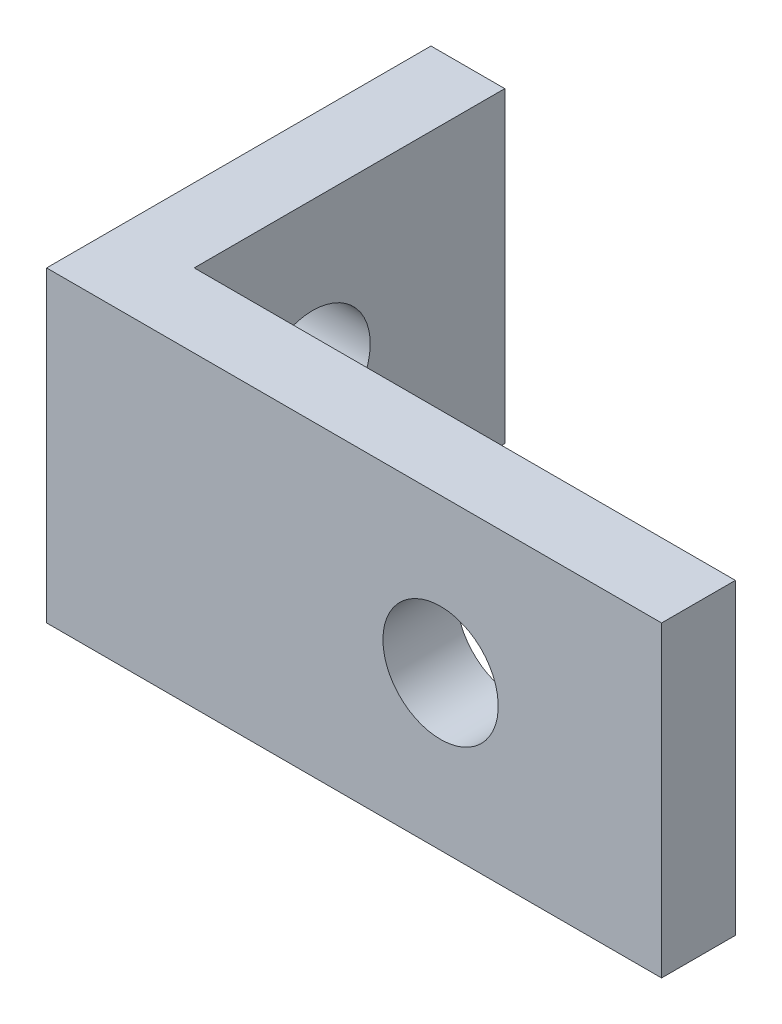
ISO-10303-21;
HEADER;
FILE_DESCRIPTION(('STEP AP214'),'2;1');
FILE_NAME('part.step','',(''),(''),'','','');
FILE_SCHEMA(('AUTOMOTIVE_DESIGN { 1 0 10303 214 1 1 1 1 }'));
ENDSEC;
DATA;
#1=APPLICATION_CONTEXT('core data for automotive mechanical design processes');
#2=APPLICATION_PROTOCOL_DEFINITION('international standard','automotive_design',2000,#1);
#3=PRODUCT_CONTEXT('',#1,'mechanical');
#4=PRODUCT('Part','Part','',(#3));
#5=PRODUCT_RELATED_PRODUCT_CATEGORY('part','',(#4));
#6=PRODUCT_DEFINITION_FORMATION('','',#4);
#7=PRODUCT_DEFINITION_CONTEXT('part definition',#1,'design');
#8=PRODUCT_DEFINITION('design','',#6,#7);
#9=PRODUCT_DEFINITION_SHAPE('','',#8);
#10=(LENGTH_UNIT() NAMED_UNIT(*) SI_UNIT(.MILLI.,.METRE.));
#11=(NAMED_UNIT(*) PLANE_ANGLE_UNIT() SI_UNIT($,.RADIAN.));
#12=(NAMED_UNIT(*) SI_UNIT($,.STERADIAN.) SOLID_ANGLE_UNIT());
#13=UNCERTAINTY_MEASURE_WITH_UNIT(LENGTH_MEASURE(1.E-05),#10,'distance_accuracy_value','');
#14=(GEOMETRIC_REPRESENTATION_CONTEXT(3) GLOBAL_UNCERTAINTY_ASSIGNED_CONTEXT((#13)) GLOBAL_UNIT_ASSIGNED_CONTEXT((#10,
#11,#12)) REPRESENTATION_CONTEXT('',''));
#15=CARTESIAN_POINT('',(0.,0.,0.));
#16=DIRECTION('',(0.,0.,1.));
#17=DIRECTION('',(1.,0.,0.));
#18=AXIS2_PLACEMENT_3D('',#15,#16,#17);
#19=CARTESIAN_POINT('',(0.,0.,3.048));
#20=DIRECTION('',(1.,0.,0.));
#21=DIRECTION('',(0.,0.,-1.));
#22=AXIS2_PLACEMENT_3D('',#19,#20,#21);
#23=PLANE('',#22);
#24=CARTESIAN_POINT('',(0.,6.35,-4.8895));
#25=DIRECTION('',(1.,0.,0.));
#26=DIRECTION('',(0.,1.,0.));
#27=AXIS2_PLACEMENT_3D('',#24,#25,#26);
#28=CIRCLE('',#27,2.38125);
#29=CARTESIAN_POINT('',(0.,8.73125,-4.8895));
#30=VERTEX_POINT('',#29);
#31=EDGE_CURVE('E166',#30,#30,#28,.T.);
#32=ORIENTED_EDGE('',*,*,#31,.T.);
#33=EDGE_LOOP('',(#32));
#34=FACE_BOUND('',#33,.T.);
#35=DIRECTION('',(0.,0.,-1.));
#36=VECTOR('',#35,1.);
#37=CARTESIAN_POINT('',(0.,12.7,3.048));
#38=LINE('',#37,#36);
#39=CARTESIAN_POINT('',(0.,12.7,3.048));
#40=VERTEX_POINT('',#39);
#41=CARTESIAN_POINT('',(0.,12.7,-12.827));
#42=VERTEX_POINT('',#41);
#43=EDGE_CURVE('E108',#40,#42,#38,.T.);
#44=ORIENTED_EDGE('',*,*,#43,.T.);
#45=DIRECTION('',(0.,-1.,0.));
#46=VECTOR('',#45,1.);
#47=CARTESIAN_POINT('',(0.,12.7,-12.827));
#48=LINE('',#47,#46);
#49=CARTESIAN_POINT('',(0.,0.,-12.827));
#50=VERTEX_POINT('',#49);
#51=EDGE_CURVE('E103',#42,#50,#48,.T.);
#52=ORIENTED_EDGE('',*,*,#51,.T.);
#53=DIRECTION('',(0.,0.,-1.));
#54=VECTOR('',#53,1.);
#55=CARTESIAN_POINT('',(0.,0.,3.048));
#56=LINE('',#55,#54);
#57=CARTESIAN_POINT('',(0.,0.,3.048));
#58=VERTEX_POINT('',#57);
#59=EDGE_CURVE('E40',#58,#50,#56,.T.);
#60=ORIENTED_EDGE('',*,*,#59,.F.);
#61=DIRECTION('',(0.,-1.,0.));
#62=VECTOR('',#61,1.);
#63=CARTESIAN_POINT('',(0.,0.,3.048));
#64=LINE('',#63,#62);
#65=EDGE_CURVE('E123',#40,#58,#64,.T.);
#66=ORIENTED_EDGE('',*,*,#65,.F.);
#67=EDGE_LOOP('',(#44,#52,#60,#66));
#68=FACE_BOUND('',#67,.T.);
#69=ADVANCED_FACE('F33',(#34,#68),#23,.F.);
#70=CARTESIAN_POINT('',(0.,0.,3.048));
#71=DIRECTION('',(0.,1.,0.));
#72=DIRECTION('',(0.,0.,1.));
#73=AXIS2_PLACEMENT_3D('',#70,#71,#72);
#74=PLANE('',#73);
#75=DIRECTION('',(0.,0.,-1.));
#76=VECTOR('',#75,1.);
#77=CARTESIAN_POINT('',(25.4,0.,3.048));
#78=LINE('',#77,#76);
#79=CARTESIAN_POINT('',(25.4,0.,3.048));
#80=VERTEX_POINT('',#79);
#81=CARTESIAN_POINT('',(25.4,0.,0.));
#82=VERTEX_POINT('',#81);
#83=EDGE_CURVE('E97',#80,#82,#78,.T.);
#84=ORIENTED_EDGE('',*,*,#83,.F.);
#85=DIRECTION('',(1.,0.,0.));
#86=VECTOR('',#85,1.);
#87=CARTESIAN_POINT('',(0.,0.,3.048));
#88=LINE('',#87,#86);
#89=EDGE_CURVE('E77',#58,#80,#88,.T.);
#90=ORIENTED_EDGE('',*,*,#89,.F.);
#91=ORIENTED_EDGE('',*,*,#59,.T.);
#92=DIRECTION('',(1.,0.,0.));
#93=VECTOR('',#92,1.);
#94=CARTESIAN_POINT('',(0.,0.,-12.827));
#95=LINE('',#94,#93);
#96=CARTESIAN_POINT('',(3.048,0.,-12.827));
#97=VERTEX_POINT('',#96);
#98=EDGE_CURVE('E93',#50,#97,#95,.T.);
#99=ORIENTED_EDGE('',*,*,#98,.T.);
#100=DIRECTION('',(0.,0.,1.));
#101=VECTOR('',#100,1.);
#102=CARTESIAN_POINT('',(3.048,0.,-12.827));
#103=LINE('',#102,#101);
#104=CARTESIAN_POINT('',(3.048,0.,0.));
#105=VERTEX_POINT('',#104);
#106=EDGE_CURVE('E47',#97,#105,#103,.T.);
#107=ORIENTED_EDGE('',*,*,#106,.T.);
#108=DIRECTION('',(1.,0.,0.));
#109=VECTOR('',#108,1.);
#110=CARTESIAN_POINT('',(0.,0.,0.));
#111=LINE('',#110,#109);
#112=EDGE_CURVE('E121',#105,#82,#111,.T.);
#113=ORIENTED_EDGE('',*,*,#112,.T.);
#114=EDGE_LOOP('',(#84,#90,#91,#99,#107,#113));
#115=FACE_BOUND('',#114,.T.);
#116=ADVANCED_FACE('F92',(#115),#74,.F.);
#117=CARTESIAN_POINT('',(25.4,0.,3.048));
#118=DIRECTION('',(-1.,0.,0.));
#119=DIRECTION('',(0.,0.,1.));
#120=AXIS2_PLACEMENT_3D('',#117,#118,#119);
#121=PLANE('',#120);
#122=DIRECTION('',(0.,1.,0.));
#123=VECTOR('',#122,1.);
#124=CARTESIAN_POINT('',(25.4,0.,0.));
#125=LINE('',#124,#123);
#126=CARTESIAN_POINT('',(25.4,12.7,0.));
#127=VERTEX_POINT('',#126);
#128=EDGE_CURVE('E70',#82,#127,#125,.T.);
#129=ORIENTED_EDGE('',*,*,#128,.T.);
#130=DIRECTION('',(0.,0.,-1.));
#131=VECTOR('',#130,1.);
#132=CARTESIAN_POINT('',(25.4,12.7,3.048));
#133=LINE('',#132,#131);
#134=CARTESIAN_POINT('',(25.4,12.7,3.048));
#135=VERTEX_POINT('',#134);
#136=EDGE_CURVE('E135',#135,#127,#133,.T.);
#137=ORIENTED_EDGE('',*,*,#136,.F.);
#138=DIRECTION('',(0.,1.,0.));
#139=VECTOR('',#138,1.);
#140=CARTESIAN_POINT('',(25.4,0.,3.048));
#141=LINE('',#140,#139);
#142=EDGE_CURVE('E127',#80,#135,#141,.T.);
#143=ORIENTED_EDGE('',*,*,#142,.F.);
#144=ORIENTED_EDGE('',*,*,#83,.T.);
#145=EDGE_LOOP('',(#129,#137,#143,#144));
#146=FACE_BOUND('',#145,.T.);
#147=ADVANCED_FACE('F138',(#146),#121,.F.);
#148=CARTESIAN_POINT('',(0.,12.7,3.048));
#149=DIRECTION('',(0.,-1.,0.));
#150=DIRECTION('',(0.,0.,-1.));
#151=AXIS2_PLACEMENT_3D('',#148,#149,#150);
#152=PLANE('',#151);
#153=DIRECTION('',(-1.,0.,0.));
#154=VECTOR('',#153,1.);
#155=CARTESIAN_POINT('',(0.,12.7,0.));
#156=LINE('',#155,#154);
#157=CARTESIAN_POINT('',(3.048,12.7,0.));
#158=VERTEX_POINT('',#157);
#159=EDGE_CURVE('E125',#127,#158,#156,.T.);
#160=ORIENTED_EDGE('',*,*,#159,.T.);
#161=DIRECTION('',(0.,0.,1.));
#162=VECTOR('',#161,1.);
#163=CARTESIAN_POINT('',(3.048,12.7,-12.827));
#164=LINE('',#163,#162);
#165=CARTESIAN_POINT('',(3.048,12.7,-12.827));
#166=VERTEX_POINT('',#165);
#167=EDGE_CURVE('E119',#166,#158,#164,.T.);
#168=ORIENTED_EDGE('',*,*,#167,.F.);
#169=DIRECTION('',(-1.,0.,0.));
#170=VECTOR('',#169,1.);
#171=CARTESIAN_POINT('',(0.,12.7,-12.827));
#172=LINE('',#171,#170);
#173=EDGE_CURVE('E117',#166,#42,#172,.T.);
#174=ORIENTED_EDGE('',*,*,#173,.T.);
#175=ORIENTED_EDGE('',*,*,#43,.F.);
#176=DIRECTION('',(-1.,0.,0.));
#177=VECTOR('',#176,1.);
#178=CARTESIAN_POINT('',(0.,12.7,3.048));
#179=LINE('',#178,#177);
#180=EDGE_CURVE('E55',#135,#40,#179,.T.);
#181=ORIENTED_EDGE('',*,*,#180,.F.);
#182=ORIENTED_EDGE('',*,*,#136,.T.);
#183=EDGE_LOOP('',(#160,#168,#174,#175,#181,#182));
#184=FACE_BOUND('',#183,.T.);
#185=ADVANCED_FACE('F145',(#184),#152,.F.);
#186=CARTESIAN_POINT('',(0.,0.,3.048));
#187=DIRECTION('',(0.,0.,-1.));
#188=DIRECTION('',(-1.,0.,0.));
#189=AXIS2_PLACEMENT_3D('',#186,#187,#188);
#190=PLANE('',#189);
#191=CARTESIAN_POINT('',(16.271875,6.35,3.048));
#192=DIRECTION('',(0.,0.,-1.));
#193=DIRECTION('',(-1.,0.,0.));
#194=AXIS2_PLACEMENT_3D('',#191,#192,#193);
#195=CIRCLE('',#194,2.38125);
#196=CARTESIAN_POINT('',(13.890625,6.35,3.048));
#197=VERTEX_POINT('',#196);
#198=EDGE_CURVE('E109',#197,#197,#195,.T.);
#199=ORIENTED_EDGE('',*,*,#198,.T.);
#200=EDGE_LOOP('',(#199));
#201=FACE_BOUND('',#200,.T.);
#202=ORIENTED_EDGE('',*,*,#180,.T.);
#203=ORIENTED_EDGE('',*,*,#65,.T.);
#204=ORIENTED_EDGE('',*,*,#89,.T.);
#205=ORIENTED_EDGE('',*,*,#142,.T.);
#206=EDGE_LOOP('',(#202,#203,#204,#205));
#207=FACE_BOUND('',#206,.T.);
#208=ADVANCED_FACE('F146',(#201,#207),#190,.F.);
#209=CARTESIAN_POINT('',(0.,0.,0.));
#210=DIRECTION('',(0.,0.,-1.));
#211=DIRECTION('',(-1.,0.,0.));
#212=AXIS2_PLACEMENT_3D('',#209,#210,#211);
#213=PLANE('',#212);
#214=CARTESIAN_POINT('',(16.271875,6.35,0.));
#215=DIRECTION('',(0.,0.,-1.));
#216=DIRECTION('',(-1.,0.,0.));
#217=AXIS2_PLACEMENT_3D('',#214,#215,#216);
#218=CIRCLE('',#217,2.38125);
#219=CARTESIAN_POINT('',(13.890625,6.35,0.));
#220=VERTEX_POINT('',#219);
#221=EDGE_CURVE('E112',#220,#220,#218,.T.);
#222=ORIENTED_EDGE('',*,*,#221,.F.);
#223=EDGE_LOOP('',(#222));
#224=FACE_BOUND('',#223,.T.);
#225=DIRECTION('',(0.,-1.,0.));
#226=VECTOR('',#225,1.);
#227=CARTESIAN_POINT('',(3.048,0.,0.));
#228=LINE('',#227,#226);
#229=EDGE_CURVE('E11',#158,#105,#228,.T.);
#230=ORIENTED_EDGE('',*,*,#229,.F.);
#231=ORIENTED_EDGE('',*,*,#159,.F.);
#232=ORIENTED_EDGE('',*,*,#128,.F.);
#233=ORIENTED_EDGE('',*,*,#112,.F.);
#234=EDGE_LOOP('',(#230,#231,#232,#233));
#235=FACE_BOUND('',#234,.T.);
#236=ADVANCED_FACE('F143',(#224,#235),#213,.T.);
#237=CARTESIAN_POINT('',(3.048,12.7,-12.827));
#238=DIRECTION('',(1.,0.,0.));
#239=DIRECTION('',(0.,1.,0.));
#240=AXIS2_PLACEMENT_3D('',#237,#238,#239);
#241=PLANE('',#240);
#242=CARTESIAN_POINT('',(3.048,6.35,-4.8895));
#243=DIRECTION('',(1.,0.,0.));
#244=DIRECTION('',(0.,1.,0.));
#245=AXIS2_PLACEMENT_3D('',#242,#243,#244);
#246=CIRCLE('',#245,2.38125);
#247=CARTESIAN_POINT('',(3.048,8.73125,-4.8895));
#248=VERTEX_POINT('',#247);
#249=EDGE_CURVE('E168',#248,#248,#246,.T.);
#250=ORIENTED_EDGE('',*,*,#249,.F.);
#251=EDGE_LOOP('',(#250));
#252=FACE_BOUND('',#251,.T.);
#253=ORIENTED_EDGE('',*,*,#167,.T.);
#254=ORIENTED_EDGE('',*,*,#229,.T.);
#255=ORIENTED_EDGE('',*,*,#106,.F.);
#256=DIRECTION('',(0.,1.,0.));
#257=VECTOR('',#256,1.);
#258=CARTESIAN_POINT('',(3.048,12.7,-12.827));
#259=LINE('',#258,#257);
#260=EDGE_CURVE('E106',#97,#166,#259,.T.);
#261=ORIENTED_EDGE('',*,*,#260,.T.);
#262=EDGE_LOOP('',(#253,#254,#255,#261));
#263=FACE_BOUND('',#262,.T.);
#264=ADVANCED_FACE('F154',(#252,#263),#241,.T.);
#265=CARTESIAN_POINT('',(0.,0.,-12.827));
#266=DIRECTION('',(0.,0.,1.));
#267=DIRECTION('',(1.,0.,0.));
#268=AXIS2_PLACEMENT_3D('',#265,#266,#267);
#269=PLANE('',#268);
#270=ORIENTED_EDGE('',*,*,#51,.F.);
#271=ORIENTED_EDGE('',*,*,#173,.F.);
#272=ORIENTED_EDGE('',*,*,#260,.F.);
#273=ORIENTED_EDGE('',*,*,#98,.F.);
#274=EDGE_LOOP('',(#270,#271,#272,#273));
#275=FACE_BOUND('',#274,.T.);
#276=ADVANCED_FACE('F101',(#275),#269,.F.);
#277=CARTESIAN_POINT('',(16.271875,6.35,3.048));
#278=DIRECTION('',(0.,0.,-1.));
#279=DIRECTION('',(-1.,0.,0.));
#280=AXIS2_PLACEMENT_3D('',#277,#278,#279);
#281=CYLINDRICAL_SURFACE('',#280,2.38125);
#282=ORIENTED_EDGE('',*,*,#198,.F.);
#283=EDGE_LOOP('',(#282));
#284=FACE_BOUND('',#283,.T.);
#285=ORIENTED_EDGE('',*,*,#221,.T.);
#286=EDGE_LOOP('',(#285));
#287=FACE_BOUND('',#286,.T.);
#288=ADVANCED_FACE('F182',(#284,#287),#281,.F.);
#289=CARTESIAN_POINT('',(0.,6.35,-4.8895));
#290=DIRECTION('',(1.,0.,0.));
#291=DIRECTION('',(0.,1.,0.));
#292=AXIS2_PLACEMENT_3D('',#289,#290,#291);
#293=CYLINDRICAL_SURFACE('',#292,2.38125);
#294=ORIENTED_EDGE('',*,*,#31,.F.);
#295=EDGE_LOOP('',(#294));
#296=FACE_BOUND('',#295,.T.);
#297=ORIENTED_EDGE('',*,*,#249,.T.);
#298=EDGE_LOOP('',(#297));
#299=FACE_BOUND('',#298,.T.);
#300=ADVANCED_FACE('F175',(#296,#299),#293,.F.);
#301=CLOSED_SHELL('',(#69,#116,#147,#185,#208,#236,#264,#276,#288,#300));
#302=MANIFOLD_SOLID_BREP('B2',#301);
#303=ADVANCED_BREP_SHAPE_REPRESENTATION('',(#18,#302),#14);
#304=SHAPE_DEFINITION_REPRESENTATION(#9,#303);
ENDSEC;
END-ISO-10303-21;
